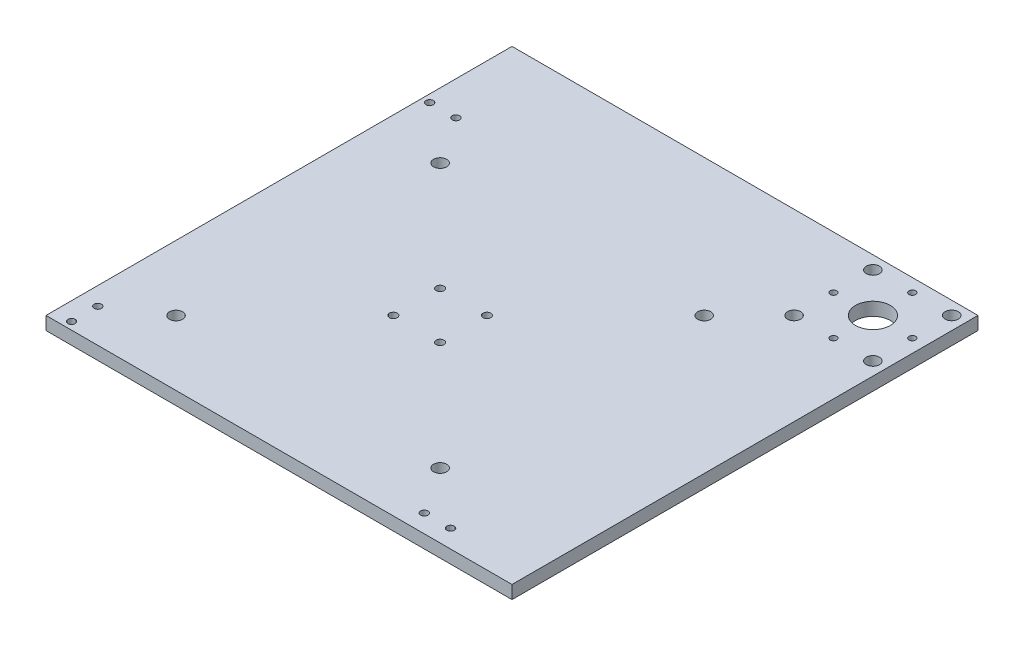
ISO-10303-21;
HEADER;
FILE_DESCRIPTION(('STEP AP214'),'2;1');
FILE_NAME('part.step','',(''),(''),'','','');
FILE_SCHEMA(('AUTOMOTIVE_DESIGN { 1 0 10303 214 1 1 1 1 }'));
ENDSEC;
DATA;
#1=APPLICATION_CONTEXT('core data for automotive mechanical design processes');
#2=APPLICATION_PROTOCOL_DEFINITION('international standard','automotive_design',2000,#1);
#3=PRODUCT_CONTEXT('',#1,'mechanical');
#4=PRODUCT('Part','Part','',(#3));
#5=PRODUCT_RELATED_PRODUCT_CATEGORY('part','',(#4));
#6=PRODUCT_DEFINITION_FORMATION('','',#4);
#7=PRODUCT_DEFINITION_CONTEXT('part definition',#1,'design');
#8=PRODUCT_DEFINITION('design','',#6,#7);
#9=PRODUCT_DEFINITION_SHAPE('','',#8);
#10=(LENGTH_UNIT() NAMED_UNIT(*) SI_UNIT(.MILLI.,.METRE.));
#11=(NAMED_UNIT(*) PLANE_ANGLE_UNIT() SI_UNIT($,.RADIAN.));
#12=(NAMED_UNIT(*) SI_UNIT($,.STERADIAN.) SOLID_ANGLE_UNIT());
#13=UNCERTAINTY_MEASURE_WITH_UNIT(LENGTH_MEASURE(1.E-05),#10,'distance_accuracy_value','');
#14=(GEOMETRIC_REPRESENTATION_CONTEXT(3) GLOBAL_UNCERTAINTY_ASSIGNED_CONTEXT((#13)) GLOBAL_UNIT_ASSIGNED_CONTEXT((#10,
#11,#12)) REPRESENTATION_CONTEXT('',''));
#15=CARTESIAN_POINT('',(0.,0.,0.));
#16=DIRECTION('',(0.,0.,1.));
#17=DIRECTION('',(1.,0.,0.));
#18=AXIS2_PLACEMENT_3D('',#15,#16,#17);
#19=CARTESIAN_POINT('',(0.,6.35,0.));
#20=DIRECTION('',(0.,1.,0.));
#21=DIRECTION('',(0.,0.,1.));
#22=AXIS2_PLACEMENT_3D('',#19,#20,#21);
#23=PLANE('',#22);
#24=CARTESIAN_POINT('',(104.600000000002,6.35000000000002,-104.6));
#25=DIRECTION('',(0.,-1.,0.));
#26=DIRECTION('',(0.,0.,-1.));
#27=AXIS2_PLACEMENT_3D('',#24,#25,#26);
#28=CIRCLE('',#27,8.41375000000001);
#29=CARTESIAN_POINT('',(104.600000000002,6.35000000000002,-113.01375));
#30=VERTEX_POINT('',#29);
#31=EDGE_CURVE('E390',#30,#30,#28,.T.);
#32=ORIENTED_EDGE('',*,*,#31,.T.);
#33=EDGE_LOOP('',(#32));
#34=FACE_BOUND('',#33,.T.);
#35=CARTESIAN_POINT('',(123.650000000001,6.35000000000002,-104.6));
#36=DIRECTION('',(0.,-1.,0.));
#37=DIRECTION('',(0.,0.,-1.));
#38=AXIS2_PLACEMENT_3D('',#35,#36,#37);
#39=CIRCLE('',#38,1.58749999999992);
#40=CARTESIAN_POINT('',(123.650000000001,6.35000000000002,-106.1875));
#41=VERTEX_POINT('',#40);
#42=EDGE_CURVE('E384',#41,#41,#39,.T.);
#43=ORIENTED_EDGE('',*,*,#42,.T.);
#44=EDGE_LOOP('',(#43));
#45=FACE_BOUND('',#44,.T.);
#46=CARTESIAN_POINT('',(104.600000000001,6.35000000000002,-85.5499999999999));
#47=DIRECTION('',(0.,-1.,0.));
#48=DIRECTION('',(0.,0.,-1.));
#49=AXIS2_PLACEMENT_3D('',#46,#47,#48);
#50=CIRCLE('',#49,1.58749999999994);
#51=CARTESIAN_POINT('',(104.600000000001,6.35000000000002,-87.1374999999998));
#52=VERTEX_POINT('',#51);
#53=EDGE_CURVE('E378',#52,#52,#50,.T.);
#54=ORIENTED_EDGE('',*,*,#53,.T.);
#55=EDGE_LOOP('',(#54));
#56=FACE_BOUND('',#55,.T.);
#57=CARTESIAN_POINT('',(85.5500000000013,6.35000000000002,-104.6));
#58=DIRECTION('',(0.,-1.,0.));
#59=DIRECTION('',(0.,0.,-1.));
#60=AXIS2_PLACEMENT_3D('',#57,#58,#59);
#61=CIRCLE('',#60,1.58749999999994);
#62=CARTESIAN_POINT('',(85.5500000000013,6.35000000000002,-106.1875));
#63=VERTEX_POINT('',#62);
#64=EDGE_CURVE('E372',#63,#63,#61,.T.);
#65=ORIENTED_EDGE('',*,*,#64,.T.);
#66=EDGE_LOOP('',(#65));
#67=FACE_BOUND('',#66,.T.);
#68=CARTESIAN_POINT('',(104.600000000001,6.35000000000002,-123.65));
#69=DIRECTION('',(0.,-1.,0.));
#70=DIRECTION('',(0.,0.,-1.));
#71=AXIS2_PLACEMENT_3D('',#68,#69,#70);
#72=CIRCLE('',#71,1.58749999999992);
#73=CARTESIAN_POINT('',(104.600000000001,6.35000000000002,-125.2375));
#74=VERTEX_POINT('',#73);
#75=EDGE_CURVE('E366',#74,#74,#72,.T.);
#76=ORIENTED_EDGE('',*,*,#75,.T.);
#77=EDGE_LOOP('',(#76));
#78=FACE_BOUND('',#77,.T.);
#79=CARTESIAN_POINT('',(85.5500000000023,6.35000000000002,-123.65));
#80=DIRECTION('',(0.,-1.,0.));
#81=DIRECTION('',(0.,0.,-1.));
#82=AXIS2_PLACEMENT_3D('',#79,#80,#81);
#83=CIRCLE('',#82,3.17499999999992);
#84=CARTESIAN_POINT('',(85.5500000000023,6.35000000000002,-126.825));
#85=VERTEX_POINT('',#84);
#86=EDGE_CURVE('E360',#85,#85,#83,.T.);
#87=ORIENTED_EDGE('',*,*,#86,.T.);
#88=EDGE_LOOP('',(#87));
#89=FACE_BOUND('',#88,.T.);
#90=CARTESIAN_POINT('',(123.650000000001,6.35000000000002,-85.5499999999997));
#91=DIRECTION('',(0.,-1.,0.));
#92=DIRECTION('',(0.,0.,-1.));
#93=AXIS2_PLACEMENT_3D('',#90,#91,#92);
#94=CIRCLE('',#93,3.17500000000064);
#95=CARTESIAN_POINT('',(123.650000000001,6.35000000000002,-88.7250000000003));
#96=VERTEX_POINT('',#95);
#97=EDGE_CURVE('E354',#96,#96,#94,.T.);
#98=ORIENTED_EDGE('',*,*,#97,.T.);
#99=EDGE_LOOP('',(#98));
#100=FACE_BOUND('',#99,.T.);
#101=CARTESIAN_POINT('',(85.5500000000007,6.35000000000002,-85.5499999999996));
#102=DIRECTION('',(0.,-1.,0.));
#103=DIRECTION('',(0.,0.,-1.));
#104=AXIS2_PLACEMENT_3D('',#101,#102,#103);
#105=CIRCLE('',#104,3.17500000000087);
#106=CARTESIAN_POINT('',(85.5500000000007,6.35000000000002,-88.7250000000005));
#107=VERTEX_POINT('',#106);
#108=EDGE_CURVE('E348',#107,#107,#105,.T.);
#109=ORIENTED_EDGE('',*,*,#108,.T.);
#110=EDGE_LOOP('',(#109));
#111=FACE_BOUND('',#110,.T.);
#112=CARTESIAN_POINT('',(123.649999999999,6.35000000000002,-123.65));
#113=DIRECTION('',(0.,-1.,0.));
#114=DIRECTION('',(0.,0.,-1.));
#115=AXIS2_PLACEMENT_3D('',#112,#113,#114);
#116=CIRCLE('',#115,3.17500000000147);
#117=CARTESIAN_POINT('',(123.649999999999,6.35000000000002,-126.825000000001));
#118=VERTEX_POINT('',#117);
#119=EDGE_CURVE('E342',#118,#118,#116,.T.);
#120=ORIENTED_EDGE('',*,*,#119,.T.);
#121=EDGE_LOOP('',(#120));
#122=FACE_BOUND('',#121,.T.);
#123=CARTESIAN_POINT('',(63.8746400504133,6.35000000000002,-63.7786400504133));
#124=DIRECTION('',(0.,-1.,0.));
#125=DIRECTION('',(0.,0.,-1.));
#126=AXIS2_PLACEMENT_3D('',#123,#124,#125);
#127=CIRCLE('',#126,3.17500000000001);
#128=CARTESIAN_POINT('',(63.8746400504133,6.35000000000002,-66.9536400504133));
#129=VERTEX_POINT('',#128);
#130=EDGE_CURVE('E336',#129,#129,#127,.T.);
#131=ORIENTED_EDGE('',*,*,#130,.T.);
#132=EDGE_LOOP('',(#131));
#133=FACE_BOUND('',#132,.T.);
#134=CARTESIAN_POINT('',(63.8746400504133,6.35000000000002,63.8746400504134));
#135=DIRECTION('',(0.,-1.,0.));
#136=DIRECTION('',(0.,0.,-1.));
#137=AXIS2_PLACEMENT_3D('',#134,#135,#136);
#138=CIRCLE('',#137,3.17500000000001);
#139=CARTESIAN_POINT('',(63.8746400504133,6.35000000000002,60.6996400504134));
#140=VERTEX_POINT('',#139);
#141=EDGE_CURVE('E330',#140,#140,#138,.T.);
#142=ORIENTED_EDGE('',*,*,#141,.T.);
#143=EDGE_LOOP('',(#142));
#144=FACE_BOUND('',#143,.T.);
#145=CARTESIAN_POINT('',(-63.7786400504134,6.35000000000002,63.8746400504134));
#146=DIRECTION('',(0.,-1.,0.));
#147=DIRECTION('',(0.,0.,-1.));
#148=AXIS2_PLACEMENT_3D('',#145,#146,#147);
#149=CIRCLE('',#148,3.17499999999995);
#150=CARTESIAN_POINT('',(-63.7786400504134,6.35000000000002,60.6996400504134));
#151=VERTEX_POINT('',#150);
#152=EDGE_CURVE('E324',#151,#151,#149,.T.);
#153=ORIENTED_EDGE('',*,*,#152,.T.);
#154=EDGE_LOOP('',(#153));
#155=FACE_BOUND('',#154,.T.);
#156=CARTESIAN_POINT('',(-63.7786400504134,6.35000000000002,-63.7786400504133));
#157=DIRECTION('',(0.,-1.,0.));
#158=DIRECTION('',(0.,0.,-1.));
#159=AXIS2_PLACEMENT_3D('',#156,#157,#158);
#160=CIRCLE('',#159,3.17499999999995);
#161=CARTESIAN_POINT('',(-63.7786400504134,6.35000000000002,-66.9536400504132));
#162=VERTEX_POINT('',#161);
#163=EDGE_CURVE('E247',#162,#162,#160,.T.);
#164=ORIENTED_EDGE('',*,*,#163,.T.);
#165=EDGE_LOOP('',(#164));
#166=FACE_BOUND('',#165,.T.);
#167=CARTESIAN_POINT('',(-11.303,6.35,-11.303));
#168=DIRECTION('',(0.,1.,0.));
#169=DIRECTION('',(0.,0.,1.));
#170=AXIS2_PLACEMENT_3D('',#167,#168,#169);
#171=CIRCLE('',#170,1.905);
#172=CARTESIAN_POINT('',(-11.303,6.35,-9.398));
#173=VERTEX_POINT('',#172);
#174=EDGE_CURVE('E258',#173,#173,#171,.T.);
#175=ORIENTED_EDGE('',*,*,#174,.F.);
#176=EDGE_LOOP('',(#175));
#177=FACE_BOUND('',#176,.T.);
#178=CARTESIAN_POINT('',(-11.303,6.35,11.303));
#179=DIRECTION('',(0.,1.,0.));
#180=DIRECTION('',(0.,0.,1.));
#181=AXIS2_PLACEMENT_3D('',#178,#179,#180);
#182=CIRCLE('',#181,1.905);
#183=CARTESIAN_POINT('',(-11.303,6.35,13.208));
#184=VERTEX_POINT('',#183);
#185=EDGE_CURVE('E270',#184,#184,#182,.T.);
#186=ORIENTED_EDGE('',*,*,#185,.F.);
#187=EDGE_LOOP('',(#186));
#188=FACE_BOUND('',#187,.T.);
#189=CARTESIAN_POINT('',(-78.9,6.35,-86.55));
#190=DIRECTION('',(0.,1.,0.));
#191=DIRECTION('',(0.,0.,1.));
#192=AXIS2_PLACEMENT_3D('',#189,#190,#191);
#193=CIRCLE('',#192,1.778);
#194=CARTESIAN_POINT('',(-78.9,6.35,-84.772));
#195=VERTEX_POINT('',#194);
#196=EDGE_CURVE('E282',#195,#195,#193,.T.);
#197=ORIENTED_EDGE('',*,*,#196,.F.);
#198=EDGE_LOOP('',(#197));
#199=FACE_BOUND('',#198,.T.);
#200=CARTESIAN_POINT('',(-86.55,6.35,78.9));
#201=DIRECTION('',(0.,1.,0.));
#202=DIRECTION('',(0.,0.,1.));
#203=AXIS2_PLACEMENT_3D('',#200,#201,#202);
#204=CIRCLE('',#203,1.778);
#205=CARTESIAN_POINT('',(-86.55,6.35,80.678));
#206=VERTEX_POINT('',#205);
#207=EDGE_CURVE('E294',#206,#206,#204,.T.);
#208=ORIENTED_EDGE('',*,*,#207,.F.);
#209=EDGE_LOOP('',(#208));
#210=FACE_BOUND('',#209,.T.);
#211=CARTESIAN_POINT('',(78.9,6.35,86.55));
#212=DIRECTION('',(0.,1.,0.));
#213=DIRECTION('',(0.,0.,1.));
#214=AXIS2_PLACEMENT_3D('',#211,#212,#213);
#215=CIRCLE('',#214,1.778);
#216=CARTESIAN_POINT('',(78.9,6.35,88.328));
#217=VERTEX_POINT('',#216);
#218=EDGE_CURVE('E306',#217,#217,#215,.T.);
#219=ORIENTED_EDGE('',*,*,#218,.F.);
#220=EDGE_LOOP('',(#219));
#221=FACE_BOUND('',#220,.T.);
#222=DIRECTION('',(1.,0.,0.));
#223=VECTOR('',#222,1.);
#224=CARTESIAN_POINT('',(-95.25,6.35,95.25));
#225=LINE('',#224,#223);
#226=CARTESIAN_POINT('',(-95.25,6.35,95.25));
#227=VERTEX_POINT('',#226);
#228=CARTESIAN_POINT('',(130.,6.35000000000002,95.25));
#229=VERTEX_POINT('',#228);
#230=EDGE_CURVE('E244',#227,#229,#225,.T.);
#231=ORIENTED_EDGE('',*,*,#230,.T.);
#232=DIRECTION('',(0.,0.,1.));
#233=VECTOR('',#232,1.);
#234=CARTESIAN_POINT('',(130.,6.35000000000002,-78.1999999999997));
#235=LINE('',#234,#233);
#236=CARTESIAN_POINT('',(130.,6.35000000000002,-130.));
#237=VERTEX_POINT('',#236);
#238=EDGE_CURVE('E223',#237,#229,#235,.T.);
#239=ORIENTED_EDGE('',*,*,#238,.F.);
#240=DIRECTION('',(-1.,0.,0.));
#241=VECTOR('',#240,1.);
#242=CARTESIAN_POINT('',(130.,6.35000000000002,-130.));
#243=LINE('',#242,#241);
#244=CARTESIAN_POINT('',(-95.25,6.35000000000002,-130.));
#245=VERTEX_POINT('',#244);
#246=EDGE_CURVE('E235',#237,#245,#243,.T.);
#247=ORIENTED_EDGE('',*,*,#246,.T.);
#248=DIRECTION('',(0.,0.,-1.));
#249=VECTOR('',#248,1.);
#250=CARTESIAN_POINT('',(-95.25,6.35,95.25));
#251=LINE('',#250,#249);
#252=EDGE_CURVE('E192',#227,#245,#251,.T.);
#253=ORIENTED_EDGE('',*,*,#252,.F.);
#254=EDGE_LOOP('',(#231,#239,#247,#253));
#255=FACE_BOUND('',#254,.T.);
#256=CARTESIAN_POINT('',(91.6,6.35,86.55));
#257=DIRECTION('',(0.,1.,0.));
#258=DIRECTION('',(0.,0.,1.));
#259=AXIS2_PLACEMENT_3D('',#256,#257,#258);
#260=CIRCLE('',#259,1.778);
#261=CARTESIAN_POINT('',(91.6,6.35,88.328));
#262=VERTEX_POINT('',#261);
#263=EDGE_CURVE('E300',#262,#262,#260,.T.);
#264=ORIENTED_EDGE('',*,*,#263,.F.);
#265=EDGE_LOOP('',(#264));
#266=FACE_BOUND('',#265,.T.);
#267=CARTESIAN_POINT('',(-86.55,6.35,91.6));
#268=DIRECTION('',(0.,1.,0.));
#269=DIRECTION('',(0.,0.,1.));
#270=AXIS2_PLACEMENT_3D('',#267,#268,#269);
#271=CIRCLE('',#270,1.778);
#272=CARTESIAN_POINT('',(-86.55,6.35,93.378));
#273=VERTEX_POINT('',#272);
#274=EDGE_CURVE('E288',#273,#273,#271,.T.);
#275=ORIENTED_EDGE('',*,*,#274,.F.);
#276=EDGE_LOOP('',(#275));
#277=FACE_BOUND('',#276,.T.);
#278=CARTESIAN_POINT('',(-91.6,6.35,-86.55));
#279=DIRECTION('',(0.,1.,0.));
#280=DIRECTION('',(0.,0.,1.));
#281=AXIS2_PLACEMENT_3D('',#278,#279,#280);
#282=CIRCLE('',#281,1.778);
#283=CARTESIAN_POINT('',(-91.6,6.35,-84.772));
#284=VERTEX_POINT('',#283);
#285=EDGE_CURVE('E276',#284,#284,#282,.T.);
#286=ORIENTED_EDGE('',*,*,#285,.F.);
#287=EDGE_LOOP('',(#286));
#288=FACE_BOUND('',#287,.T.);
#289=CARTESIAN_POINT('',(11.303,6.35,11.303));
#290=DIRECTION('',(0.,1.,0.));
#291=DIRECTION('',(0.,0.,1.));
#292=AXIS2_PLACEMENT_3D('',#289,#290,#291);
#293=CIRCLE('',#292,1.905);
#294=CARTESIAN_POINT('',(11.303,6.35,13.208));
#295=VERTEX_POINT('',#294);
#296=EDGE_CURVE('E264',#295,#295,#293,.T.);
#297=ORIENTED_EDGE('',*,*,#296,.F.);
#298=EDGE_LOOP('',(#297));
#299=FACE_BOUND('',#298,.T.);
#300=CARTESIAN_POINT('',(11.303,6.35,-11.303));
#301=DIRECTION('',(0.,1.,0.));
#302=DIRECTION('',(0.,0.,1.));
#303=AXIS2_PLACEMENT_3D('',#300,#301,#302);
#304=CIRCLE('',#303,1.905);
#305=CARTESIAN_POINT('',(11.303,6.35,-9.398));
#306=VERTEX_POINT('',#305);
#307=EDGE_CURVE('E252',#306,#306,#304,.T.);
#308=ORIENTED_EDGE('',*,*,#307,.F.);
#309=EDGE_LOOP('',(#308));
#310=FACE_BOUND('',#309,.T.);
#311=ADVANCED_FACE('F183',(#34,#45,#56,#67,#78,#89,#100,#111,#122,#133,#144,#155,#166,#177,#188,
#199,#210,#221,#255,#266,#277,#288,#299,#310),#23,.T.);
#312=CARTESIAN_POINT('',(0.,0.,0.));
#313=DIRECTION('',(0.,1.,0.));
#314=DIRECTION('',(0.,0.,1.));
#315=AXIS2_PLACEMENT_3D('',#312,#313,#314);
#316=PLANE('',#315);
#317=CARTESIAN_POINT('',(104.600000000002,0.,-104.6));
#318=DIRECTION('',(0.,-1.,0.));
#319=DIRECTION('',(0.,0.,-1.));
#320=AXIS2_PLACEMENT_3D('',#317,#318,#319);
#321=CIRCLE('',#320,8.41375000000001);
#322=CARTESIAN_POINT('',(104.600000000002,0.,-113.01375));
#323=VERTEX_POINT('',#322);
#324=EDGE_CURVE('E393',#323,#323,#321,.T.);
#325=ORIENTED_EDGE('',*,*,#324,.F.);
#326=EDGE_LOOP('',(#325));
#327=FACE_BOUND('',#326,.T.);
#328=CARTESIAN_POINT('',(123.650000000001,0.,-104.6));
#329=DIRECTION('',(0.,-1.,0.));
#330=DIRECTION('',(0.,0.,-1.));
#331=AXIS2_PLACEMENT_3D('',#328,#329,#330);
#332=CIRCLE('',#331,1.58749999999992);
#333=CARTESIAN_POINT('',(123.650000000001,0.,-106.1875));
#334=VERTEX_POINT('',#333);
#335=EDGE_CURVE('E387',#334,#334,#332,.T.);
#336=ORIENTED_EDGE('',*,*,#335,.F.);
#337=EDGE_LOOP('',(#336));
#338=FACE_BOUND('',#337,.T.);
#339=CARTESIAN_POINT('',(104.600000000001,0.,-85.5499999999999));
#340=DIRECTION('',(0.,-1.,0.));
#341=DIRECTION('',(0.,0.,-1.));
#342=AXIS2_PLACEMENT_3D('',#339,#340,#341);
#343=CIRCLE('',#342,1.58749999999994);
#344=CARTESIAN_POINT('',(104.600000000001,0.,-87.1374999999998));
#345=VERTEX_POINT('',#344);
#346=EDGE_CURVE('E381',#345,#345,#343,.T.);
#347=ORIENTED_EDGE('',*,*,#346,.F.);
#348=EDGE_LOOP('',(#347));
#349=FACE_BOUND('',#348,.T.);
#350=CARTESIAN_POINT('',(85.5500000000013,0.,-104.6));
#351=DIRECTION('',(0.,-1.,0.));
#352=DIRECTION('',(0.,0.,-1.));
#353=AXIS2_PLACEMENT_3D('',#350,#351,#352);
#354=CIRCLE('',#353,1.58749999999994);
#355=CARTESIAN_POINT('',(85.5500000000013,0.,-106.1875));
#356=VERTEX_POINT('',#355);
#357=EDGE_CURVE('E375',#356,#356,#354,.T.);
#358=ORIENTED_EDGE('',*,*,#357,.F.);
#359=EDGE_LOOP('',(#358));
#360=FACE_BOUND('',#359,.T.);
#361=CARTESIAN_POINT('',(104.600000000001,0.,-123.65));
#362=DIRECTION('',(0.,-1.,0.));
#363=DIRECTION('',(0.,0.,-1.));
#364=AXIS2_PLACEMENT_3D('',#361,#362,#363);
#365=CIRCLE('',#364,1.58749999999992);
#366=CARTESIAN_POINT('',(104.600000000001,0.,-125.2375));
#367=VERTEX_POINT('',#366);
#368=EDGE_CURVE('E369',#367,#367,#365,.T.);
#369=ORIENTED_EDGE('',*,*,#368,.F.);
#370=EDGE_LOOP('',(#369));
#371=FACE_BOUND('',#370,.T.);
#372=CARTESIAN_POINT('',(85.5500000000023,0.,-123.65));
#373=DIRECTION('',(0.,-1.,0.));
#374=DIRECTION('',(0.,0.,-1.));
#375=AXIS2_PLACEMENT_3D('',#372,#373,#374);
#376=CIRCLE('',#375,3.17499999999992);
#377=CARTESIAN_POINT('',(85.5500000000023,0.,-126.825));
#378=VERTEX_POINT('',#377);
#379=EDGE_CURVE('E363',#378,#378,#376,.T.);
#380=ORIENTED_EDGE('',*,*,#379,.F.);
#381=EDGE_LOOP('',(#380));
#382=FACE_BOUND('',#381,.T.);
#383=CARTESIAN_POINT('',(123.650000000001,0.,-85.5499999999997));
#384=DIRECTION('',(0.,-1.,0.));
#385=DIRECTION('',(0.,0.,-1.));
#386=AXIS2_PLACEMENT_3D('',#383,#384,#385);
#387=CIRCLE('',#386,3.17500000000064);
#388=CARTESIAN_POINT('',(123.650000000001,0.,-88.7250000000003));
#389=VERTEX_POINT('',#388);
#390=EDGE_CURVE('E357',#389,#389,#387,.T.);
#391=ORIENTED_EDGE('',*,*,#390,.F.);
#392=EDGE_LOOP('',(#391));
#393=FACE_BOUND('',#392,.T.);
#394=CARTESIAN_POINT('',(85.5500000000007,0.,-85.5499999999996));
#395=DIRECTION('',(0.,-1.,0.));
#396=DIRECTION('',(0.,0.,-1.));
#397=AXIS2_PLACEMENT_3D('',#394,#395,#396);
#398=CIRCLE('',#397,3.17500000000087);
#399=CARTESIAN_POINT('',(85.5500000000007,0.,-88.7250000000005));
#400=VERTEX_POINT('',#399);
#401=EDGE_CURVE('E351',#400,#400,#398,.T.);
#402=ORIENTED_EDGE('',*,*,#401,.F.);
#403=EDGE_LOOP('',(#402));
#404=FACE_BOUND('',#403,.T.);
#405=CARTESIAN_POINT('',(123.649999999999,0.,-123.65));
#406=DIRECTION('',(0.,-1.,0.));
#407=DIRECTION('',(0.,0.,-1.));
#408=AXIS2_PLACEMENT_3D('',#405,#406,#407);
#409=CIRCLE('',#408,3.17500000000147);
#410=CARTESIAN_POINT('',(123.649999999999,0.,-126.825000000001));
#411=VERTEX_POINT('',#410);
#412=EDGE_CURVE('E345',#411,#411,#409,.T.);
#413=ORIENTED_EDGE('',*,*,#412,.F.);
#414=EDGE_LOOP('',(#413));
#415=FACE_BOUND('',#414,.T.);
#416=CARTESIAN_POINT('',(63.8746400504133,0.,-63.7786400504133));
#417=DIRECTION('',(0.,-1.,0.));
#418=DIRECTION('',(0.,0.,-1.));
#419=AXIS2_PLACEMENT_3D('',#416,#417,#418);
#420=CIRCLE('',#419,3.17500000000001);
#421=CARTESIAN_POINT('',(63.8746400504133,0.,-66.9536400504133));
#422=VERTEX_POINT('',#421);
#423=EDGE_CURVE('E339',#422,#422,#420,.T.);
#424=ORIENTED_EDGE('',*,*,#423,.F.);
#425=EDGE_LOOP('',(#424));
#426=FACE_BOUND('',#425,.T.);
#427=CARTESIAN_POINT('',(63.8746400504133,0.,63.8746400504134));
#428=DIRECTION('',(0.,-1.,0.));
#429=DIRECTION('',(0.,0.,-1.));
#430=AXIS2_PLACEMENT_3D('',#427,#428,#429);
#431=CIRCLE('',#430,3.17500000000001);
#432=CARTESIAN_POINT('',(63.8746400504133,0.,60.6996400504134));
#433=VERTEX_POINT('',#432);
#434=EDGE_CURVE('E333',#433,#433,#431,.T.);
#435=ORIENTED_EDGE('',*,*,#434,.F.);
#436=EDGE_LOOP('',(#435));
#437=FACE_BOUND('',#436,.T.);
#438=CARTESIAN_POINT('',(-63.7786400504134,0.,63.8746400504134));
#439=DIRECTION('',(0.,-1.,0.));
#440=DIRECTION('',(0.,0.,-1.));
#441=AXIS2_PLACEMENT_3D('',#438,#439,#440);
#442=CIRCLE('',#441,3.17499999999995);
#443=CARTESIAN_POINT('',(-63.7786400504134,0.,60.6996400504134));
#444=VERTEX_POINT('',#443);
#445=EDGE_CURVE('E327',#444,#444,#442,.T.);
#446=ORIENTED_EDGE('',*,*,#445,.F.);
#447=EDGE_LOOP('',(#446));
#448=FACE_BOUND('',#447,.T.);
#449=CARTESIAN_POINT('',(-63.7786400504134,0.,-63.7786400504133));
#450=DIRECTION('',(0.,-1.,0.));
#451=DIRECTION('',(0.,0.,-1.));
#452=AXIS2_PLACEMENT_3D('',#449,#450,#451);
#453=CIRCLE('',#452,3.17499999999995);
#454=CARTESIAN_POINT('',(-63.7786400504134,0.,-66.9536400504132));
#455=VERTEX_POINT('',#454);
#456=EDGE_CURVE('E321',#455,#455,#453,.T.);
#457=ORIENTED_EDGE('',*,*,#456,.F.);
#458=EDGE_LOOP('',(#457));
#459=FACE_BOUND('',#458,.T.);
#460=CARTESIAN_POINT('',(-11.303,0.,-11.303));
#461=DIRECTION('',(0.,1.,0.));
#462=DIRECTION('',(0.,0.,1.));
#463=AXIS2_PLACEMENT_3D('',#460,#461,#462);
#464=CIRCLE('',#463,1.905);
#465=CARTESIAN_POINT('',(-11.303,0.,-9.398));
#466=VERTEX_POINT('',#465);
#467=EDGE_CURVE('E255',#466,#466,#464,.T.);
#468=ORIENTED_EDGE('',*,*,#467,.T.);
#469=EDGE_LOOP('',(#468));
#470=FACE_BOUND('',#469,.T.);
#471=CARTESIAN_POINT('',(-11.303,0.,11.303));
#472=DIRECTION('',(0.,1.,0.));
#473=DIRECTION('',(0.,0.,1.));
#474=AXIS2_PLACEMENT_3D('',#471,#472,#473);
#475=CIRCLE('',#474,1.905);
#476=CARTESIAN_POINT('',(-11.303,0.,13.208));
#477=VERTEX_POINT('',#476);
#478=EDGE_CURVE('E267',#477,#477,#475,.T.);
#479=ORIENTED_EDGE('',*,*,#478,.T.);
#480=EDGE_LOOP('',(#479));
#481=FACE_BOUND('',#480,.T.);
#482=CARTESIAN_POINT('',(-78.9,0.,-86.55));
#483=DIRECTION('',(0.,1.,0.));
#484=DIRECTION('',(0.,0.,1.));
#485=AXIS2_PLACEMENT_3D('',#482,#483,#484);
#486=CIRCLE('',#485,1.778);
#487=CARTESIAN_POINT('',(-78.9,0.,-84.772));
#488=VERTEX_POINT('',#487);
#489=EDGE_CURVE('E279',#488,#488,#486,.T.);
#490=ORIENTED_EDGE('',*,*,#489,.T.);
#491=EDGE_LOOP('',(#490));
#492=FACE_BOUND('',#491,.T.);
#493=CARTESIAN_POINT('',(-86.55,0.,78.9));
#494=DIRECTION('',(0.,1.,0.));
#495=DIRECTION('',(0.,0.,1.));
#496=AXIS2_PLACEMENT_3D('',#493,#494,#495);
#497=CIRCLE('',#496,1.778);
#498=CARTESIAN_POINT('',(-86.55,0.,80.678));
#499=VERTEX_POINT('',#498);
#500=EDGE_CURVE('E291',#499,#499,#497,.T.);
#501=ORIENTED_EDGE('',*,*,#500,.T.);
#502=EDGE_LOOP('',(#501));
#503=FACE_BOUND('',#502,.T.);
#504=CARTESIAN_POINT('',(78.9,0.,86.55));
#505=DIRECTION('',(0.,1.,0.));
#506=DIRECTION('',(0.,0.,1.));
#507=AXIS2_PLACEMENT_3D('',#504,#505,#506);
#508=CIRCLE('',#507,1.778);
#509=CARTESIAN_POINT('',(78.9,0.,88.328));
#510=VERTEX_POINT('',#509);
#511=EDGE_CURVE('E303',#510,#510,#508,.T.);
#512=ORIENTED_EDGE('',*,*,#511,.T.);
#513=EDGE_LOOP('',(#512));
#514=FACE_BOUND('',#513,.T.);
#515=DIRECTION('',(1.,0.,0.));
#516=VECTOR('',#515,1.);
#517=CARTESIAN_POINT('',(-95.25,0.,95.25));
#518=LINE('',#517,#516);
#519=CARTESIAN_POINT('',(-95.25,0.,95.25));
#520=VERTEX_POINT('',#519);
#521=CARTESIAN_POINT('',(130.,0.,95.25));
#522=VERTEX_POINT('',#521);
#523=EDGE_CURVE('E309',#520,#522,#518,.T.);
#524=ORIENTED_EDGE('',*,*,#523,.F.);
#525=DIRECTION('',(0.,0.,-1.));
#526=VECTOR('',#525,1.);
#527=CARTESIAN_POINT('',(-95.25,0.,95.25));
#528=LINE('',#527,#526);
#529=CARTESIAN_POINT('',(-95.25,0.,-130.));
#530=VERTEX_POINT('',#529);
#531=EDGE_CURVE('E313',#520,#530,#528,.T.);
#532=ORIENTED_EDGE('',*,*,#531,.T.);
#533=DIRECTION('',(-1.,0.,0.));
#534=VECTOR('',#533,1.);
#535=CARTESIAN_POINT('',(130.,0.,-130.));
#536=LINE('',#535,#534);
#537=CARTESIAN_POINT('',(130.,0.,-130.));
#538=VERTEX_POINT('',#537);
#539=EDGE_CURVE('E230',#538,#530,#536,.T.);
#540=ORIENTED_EDGE('',*,*,#539,.F.);
#541=DIRECTION('',(0.,0.,1.));
#542=VECTOR('',#541,1.);
#543=CARTESIAN_POINT('',(130.,0.,-78.1999999999997));
#544=LINE('',#543,#542);
#545=EDGE_CURVE('E226',#538,#522,#544,.T.);
#546=ORIENTED_EDGE('',*,*,#545,.T.);
#547=EDGE_LOOP('',(#524,#532,#540,#546));
#548=FACE_BOUND('',#547,.T.);
#549=CARTESIAN_POINT('',(91.6,0.,86.55));
#550=DIRECTION('',(0.,1.,0.));
#551=DIRECTION('',(0.,0.,1.));
#552=AXIS2_PLACEMENT_3D('',#549,#550,#551);
#553=CIRCLE('',#552,1.778);
#554=CARTESIAN_POINT('',(91.6,0.,88.328));
#555=VERTEX_POINT('',#554);
#556=EDGE_CURVE('E297',#555,#555,#553,.T.);
#557=ORIENTED_EDGE('',*,*,#556,.T.);
#558=EDGE_LOOP('',(#557));
#559=FACE_BOUND('',#558,.T.);
#560=CARTESIAN_POINT('',(-86.55,0.,91.6));
#561=DIRECTION('',(0.,1.,0.));
#562=DIRECTION('',(0.,0.,1.));
#563=AXIS2_PLACEMENT_3D('',#560,#561,#562);
#564=CIRCLE('',#563,1.778);
#565=CARTESIAN_POINT('',(-86.55,0.,93.378));
#566=VERTEX_POINT('',#565);
#567=EDGE_CURVE('E285',#566,#566,#564,.T.);
#568=ORIENTED_EDGE('',*,*,#567,.T.);
#569=EDGE_LOOP('',(#568));
#570=FACE_BOUND('',#569,.T.);
#571=CARTESIAN_POINT('',(-91.6,0.,-86.55));
#572=DIRECTION('',(0.,1.,0.));
#573=DIRECTION('',(0.,0.,1.));
#574=AXIS2_PLACEMENT_3D('',#571,#572,#573);
#575=CIRCLE('',#574,1.778);
#576=CARTESIAN_POINT('',(-91.6,0.,-84.772));
#577=VERTEX_POINT('',#576);
#578=EDGE_CURVE('E273',#577,#577,#575,.T.);
#579=ORIENTED_EDGE('',*,*,#578,.T.);
#580=EDGE_LOOP('',(#579));
#581=FACE_BOUND('',#580,.T.);
#582=CARTESIAN_POINT('',(11.303,0.,11.303));
#583=DIRECTION('',(0.,1.,0.));
#584=DIRECTION('',(0.,0.,1.));
#585=AXIS2_PLACEMENT_3D('',#582,#583,#584);
#586=CIRCLE('',#585,1.905);
#587=CARTESIAN_POINT('',(11.303,0.,13.208));
#588=VERTEX_POINT('',#587);
#589=EDGE_CURVE('E261',#588,#588,#586,.T.);
#590=ORIENTED_EDGE('',*,*,#589,.T.);
#591=EDGE_LOOP('',(#590));
#592=FACE_BOUND('',#591,.T.);
#593=CARTESIAN_POINT('',(11.303,0.,-11.303));
#594=DIRECTION('',(0.,1.,0.));
#595=DIRECTION('',(0.,0.,1.));
#596=AXIS2_PLACEMENT_3D('',#593,#594,#595);
#597=CIRCLE('',#596,1.905);
#598=CARTESIAN_POINT('',(11.303,0.,-9.398));
#599=VERTEX_POINT('',#598);
#600=EDGE_CURVE('E241',#599,#599,#597,.T.);
#601=ORIENTED_EDGE('',*,*,#600,.T.);
#602=EDGE_LOOP('',(#601));
#603=FACE_BOUND('',#602,.T.);
#604=ADVANCED_FACE('F317',(#327,#338,#349,#360,#371,#382,#393,#404,#415,#426,#437,#448,#459,
#470,#481,#492,#503,#514,#548,#559,#570,#581,#592,#603),#316,.F.);
#605=CARTESIAN_POINT('',(-95.25,6.35,95.25));
#606=DIRECTION('',(0.,0.,-1.));
#607=DIRECTION('',(-1.,0.,0.));
#608=AXIS2_PLACEMENT_3D('',#605,#606,#607);
#609=PLANE('',#608);
#610=ORIENTED_EDGE('',*,*,#523,.T.);
#611=DIRECTION('',(0.,-1.,0.));
#612=VECTOR('',#611,1.);
#613=CARTESIAN_POINT('',(130.,324.90160492454,95.25));
#614=LINE('',#613,#612);
#615=EDGE_CURVE('E231',#229,#522,#614,.T.);
#616=ORIENTED_EDGE('',*,*,#615,.F.);
#617=ORIENTED_EDGE('',*,*,#230,.F.);
#618=DIRECTION('',(0.,-1.,0.));
#619=VECTOR('',#618,1.);
#620=CARTESIAN_POINT('',(-95.25,6.35,95.25));
#621=LINE('',#620,#619);
#622=EDGE_CURVE('E12',#227,#520,#621,.T.);
#623=ORIENTED_EDGE('',*,*,#622,.T.);
#624=EDGE_LOOP('',(#610,#616,#617,#623));
#625=FACE_BOUND('',#624,.T.);
#626=ADVANCED_FACE('F185',(#625),#609,.F.);
#627=CARTESIAN_POINT('',(-95.25,6.35,95.25));
#628=DIRECTION('',(-1.,0.,0.));
#629=DIRECTION('',(0.,0.,1.));
#630=AXIS2_PLACEMENT_3D('',#627,#628,#629);
#631=PLANE('',#630);
#632=ORIENTED_EDGE('',*,*,#531,.F.);
#633=ORIENTED_EDGE('',*,*,#622,.F.);
#634=ORIENTED_EDGE('',*,*,#252,.T.);
#635=DIRECTION('',(0.,-1.,0.));
#636=VECTOR('',#635,1.);
#637=CARTESIAN_POINT('',(-95.25,324.90160492454,-130.));
#638=LINE('',#637,#636);
#639=EDGE_CURVE('E238',#245,#530,#638,.T.);
#640=ORIENTED_EDGE('',*,*,#639,.T.);
#641=EDGE_LOOP('',(#632,#633,#634,#640));
#642=FACE_BOUND('',#641,.T.);
#643=ADVANCED_FACE('F319',(#642),#631,.T.);
#644=CARTESIAN_POINT('',(78.9,6.35,86.55));
#645=DIRECTION('',(0.,-1.,0.));
#646=DIRECTION('',(0.,0.,-1.));
#647=AXIS2_PLACEMENT_3D('',#644,#645,#646);
#648=CYLINDRICAL_SURFACE('',#647,1.778);
#649=ORIENTED_EDGE('',*,*,#218,.T.);
#650=EDGE_LOOP('',(#649));
#651=FACE_BOUND('',#650,.T.);
#652=ORIENTED_EDGE('',*,*,#511,.F.);
#653=EDGE_LOOP('',(#652));
#654=FACE_BOUND('',#653,.T.);
#655=ADVANCED_FACE('F445',(#651,#654),#648,.F.);
#656=CARTESIAN_POINT('',(91.6,6.35,86.55));
#657=DIRECTION('',(0.,-1.,0.));
#658=DIRECTION('',(0.,0.,-1.));
#659=AXIS2_PLACEMENT_3D('',#656,#657,#658);
#660=CYLINDRICAL_SURFACE('',#659,1.778);
#661=ORIENTED_EDGE('',*,*,#263,.T.);
#662=EDGE_LOOP('',(#661));
#663=FACE_BOUND('',#662,.T.);
#664=ORIENTED_EDGE('',*,*,#556,.F.);
#665=EDGE_LOOP('',(#664));
#666=FACE_BOUND('',#665,.T.);
#667=ADVANCED_FACE('F447',(#663,#666),#660,.F.);
#668=CARTESIAN_POINT('',(-86.55,6.35,78.9));
#669=DIRECTION('',(0.,-1.,0.));
#670=DIRECTION('',(0.,0.,-1.));
#671=AXIS2_PLACEMENT_3D('',#668,#669,#670);
#672=CYLINDRICAL_SURFACE('',#671,1.778);
#673=ORIENTED_EDGE('',*,*,#207,.T.);
#674=EDGE_LOOP('',(#673));
#675=FACE_BOUND('',#674,.T.);
#676=ORIENTED_EDGE('',*,*,#500,.F.);
#677=EDGE_LOOP('',(#676));
#678=FACE_BOUND('',#677,.T.);
#679=ADVANCED_FACE('F454',(#675,#678),#672,.F.);
#680=CARTESIAN_POINT('',(-86.55,6.35,91.6));
#681=DIRECTION('',(0.,-1.,0.));
#682=DIRECTION('',(0.,0.,-1.));
#683=AXIS2_PLACEMENT_3D('',#680,#681,#682);
#684=CYLINDRICAL_SURFACE('',#683,1.778);
#685=ORIENTED_EDGE('',*,*,#274,.T.);
#686=EDGE_LOOP('',(#685));
#687=FACE_BOUND('',#686,.T.);
#688=ORIENTED_EDGE('',*,*,#567,.F.);
#689=EDGE_LOOP('',(#688));
#690=FACE_BOUND('',#689,.T.);
#691=ADVANCED_FACE('F650',(#687,#690),#684,.F.);
#692=CARTESIAN_POINT('',(-78.9,6.35,-86.55));
#693=DIRECTION('',(0.,-1.,0.));
#694=DIRECTION('',(0.,0.,-1.));
#695=AXIS2_PLACEMENT_3D('',#692,#693,#694);
#696=CYLINDRICAL_SURFACE('',#695,1.778);
#697=ORIENTED_EDGE('',*,*,#196,.T.);
#698=EDGE_LOOP('',(#697));
#699=FACE_BOUND('',#698,.T.);
#700=ORIENTED_EDGE('',*,*,#489,.F.);
#701=EDGE_LOOP('',(#700));
#702=FACE_BOUND('',#701,.T.);
#703=ADVANCED_FACE('F646',(#699,#702),#696,.F.);
#704=CARTESIAN_POINT('',(-91.6,6.35,-86.55));
#705=DIRECTION('',(0.,-1.,0.));
#706=DIRECTION('',(0.,0.,-1.));
#707=AXIS2_PLACEMENT_3D('',#704,#705,#706);
#708=CYLINDRICAL_SURFACE('',#707,1.778);
#709=ORIENTED_EDGE('',*,*,#285,.T.);
#710=EDGE_LOOP('',(#709));
#711=FACE_BOUND('',#710,.T.);
#712=ORIENTED_EDGE('',*,*,#578,.F.);
#713=EDGE_LOOP('',(#712));
#714=FACE_BOUND('',#713,.T.);
#715=ADVANCED_FACE('F642',(#711,#714),#708,.F.);
#716=CARTESIAN_POINT('',(-11.303,6.35,11.303));
#717=DIRECTION('',(0.,-1.,0.));
#718=DIRECTION('',(0.,0.,-1.));
#719=AXIS2_PLACEMENT_3D('',#716,#717,#718);
#720=CYLINDRICAL_SURFACE('',#719,1.905);
#721=ORIENTED_EDGE('',*,*,#185,.T.);
#722=EDGE_LOOP('',(#721));
#723=FACE_BOUND('',#722,.T.);
#724=ORIENTED_EDGE('',*,*,#478,.F.);
#725=EDGE_LOOP('',(#724));
#726=FACE_BOUND('',#725,.T.);
#727=ADVANCED_FACE('F638',(#723,#726),#720,.F.);
#728=CARTESIAN_POINT('',(11.303,6.35,11.303));
#729=DIRECTION('',(0.,-1.,0.));
#730=DIRECTION('',(0.,0.,-1.));
#731=AXIS2_PLACEMENT_3D('',#728,#729,#730);
#732=CYLINDRICAL_SURFACE('',#731,1.905);
#733=ORIENTED_EDGE('',*,*,#296,.T.);
#734=EDGE_LOOP('',(#733));
#735=FACE_BOUND('',#734,.T.);
#736=ORIENTED_EDGE('',*,*,#589,.F.);
#737=EDGE_LOOP('',(#736));
#738=FACE_BOUND('',#737,.T.);
#739=ADVANCED_FACE('F634',(#735,#738),#732,.F.);
#740=CARTESIAN_POINT('',(-11.303,6.35,-11.303));
#741=DIRECTION('',(0.,-1.,0.));
#742=DIRECTION('',(0.,0.,-1.));
#743=AXIS2_PLACEMENT_3D('',#740,#741,#742);
#744=CYLINDRICAL_SURFACE('',#743,1.905);
#745=ORIENTED_EDGE('',*,*,#174,.T.);
#746=EDGE_LOOP('',(#745));
#747=FACE_BOUND('',#746,.T.);
#748=ORIENTED_EDGE('',*,*,#467,.F.);
#749=EDGE_LOOP('',(#748));
#750=FACE_BOUND('',#749,.T.);
#751=ADVANCED_FACE('F630',(#747,#750),#744,.F.);
#752=CARTESIAN_POINT('',(11.303,6.35,-11.303));
#753=DIRECTION('',(0.,-1.,0.));
#754=DIRECTION('',(0.,0.,-1.));
#755=AXIS2_PLACEMENT_3D('',#752,#753,#754);
#756=CYLINDRICAL_SURFACE('',#755,1.905);
#757=ORIENTED_EDGE('',*,*,#307,.T.);
#758=EDGE_LOOP('',(#757));
#759=FACE_BOUND('',#758,.T.);
#760=ORIENTED_EDGE('',*,*,#600,.F.);
#761=EDGE_LOOP('',(#760));
#762=FACE_BOUND('',#761,.T.);
#763=ADVANCED_FACE('F489',(#759,#762),#756,.F.);
#764=CARTESIAN_POINT('',(130.,324.90160492454,-78.1999999999997));
#765=DIRECTION('',(1.,0.,0.));
#766=DIRECTION('',(0.,0.,-1.));
#767=AXIS2_PLACEMENT_3D('',#764,#765,#766);
#768=PLANE('',#767);
#769=DIRECTION('',(0.,-1.,0.));
#770=VECTOR('',#769,1.);
#771=CARTESIAN_POINT('',(130.,324.90160492454,-130.));
#772=LINE('',#771,#770);
#773=EDGE_CURVE('E218',#237,#538,#772,.T.);
#774=ORIENTED_EDGE('',*,*,#773,.F.);
#775=ORIENTED_EDGE('',*,*,#238,.T.);
#776=ORIENTED_EDGE('',*,*,#615,.T.);
#777=ORIENTED_EDGE('',*,*,#545,.F.);
#778=EDGE_LOOP('',(#774,#775,#776,#777));
#779=FACE_BOUND('',#778,.T.);
#780=ADVANCED_FACE('F220',(#779),#768,.T.);
#781=CARTESIAN_POINT('',(130.,324.90160492454,-130.));
#782=DIRECTION('',(0.,0.,1.));
#783=DIRECTION('',(1.,0.,0.));
#784=AXIS2_PLACEMENT_3D('',#781,#782,#783);
#785=PLANE('',#784);
#786=ORIENTED_EDGE('',*,*,#246,.F.);
#787=ORIENTED_EDGE('',*,*,#773,.T.);
#788=ORIENTED_EDGE('',*,*,#539,.T.);
#789=ORIENTED_EDGE('',*,*,#639,.F.);
#790=EDGE_LOOP('',(#786,#787,#788,#789));
#791=FACE_BOUND('',#790,.T.);
#792=ADVANCED_FACE('F236',(#791),#785,.F.);
#793=CARTESIAN_POINT('',(-63.7786400504134,6.35000000000002,-63.7786400504133));
#794=DIRECTION('',(0.,-1.,0.));
#795=DIRECTION('',(0.,0.,-1.));
#796=AXIS2_PLACEMENT_3D('',#793,#794,#795);
#797=CYLINDRICAL_SURFACE('',#796,3.17499999999995);
#798=ORIENTED_EDGE('',*,*,#163,.F.);
#799=EDGE_LOOP('',(#798));
#800=FACE_BOUND('',#799,.T.);
#801=ORIENTED_EDGE('',*,*,#456,.T.);
#802=EDGE_LOOP('',(#801));
#803=FACE_BOUND('',#802,.T.);
#804=ADVANCED_FACE('F500',(#800,#803),#797,.F.);
#805=CARTESIAN_POINT('',(-63.7786400504134,6.35000000000002,63.8746400504134));
#806=DIRECTION('',(0.,-1.,0.));
#807=DIRECTION('',(0.,0.,-1.));
#808=AXIS2_PLACEMENT_3D('',#805,#806,#807);
#809=CYLINDRICAL_SURFACE('',#808,3.17499999999995);
#810=ORIENTED_EDGE('',*,*,#152,.F.);
#811=EDGE_LOOP('',(#810));
#812=FACE_BOUND('',#811,.T.);
#813=ORIENTED_EDGE('',*,*,#445,.T.);
#814=EDGE_LOOP('',(#813));
#815=FACE_BOUND('',#814,.T.);
#816=ADVANCED_FACE('F509',(#812,#815),#809,.F.);
#817=CARTESIAN_POINT('',(63.8746400504133,6.35000000000002,63.8746400504134));
#818=DIRECTION('',(0.,-1.,0.));
#819=DIRECTION('',(0.,0.,-1.));
#820=AXIS2_PLACEMENT_3D('',#817,#818,#819);
#821=CYLINDRICAL_SURFACE('',#820,3.17500000000001);
#822=ORIENTED_EDGE('',*,*,#141,.F.);
#823=EDGE_LOOP('',(#822));
#824=FACE_BOUND('',#823,.T.);
#825=ORIENTED_EDGE('',*,*,#434,.T.);
#826=EDGE_LOOP('',(#825));
#827=FACE_BOUND('',#826,.T.);
#828=ADVANCED_FACE('F519',(#824,#827),#821,.F.);
#829=CARTESIAN_POINT('',(63.8746400504133,6.35000000000002,-63.7786400504133));
#830=DIRECTION('',(0.,-1.,0.));
#831=DIRECTION('',(0.,0.,-1.));
#832=AXIS2_PLACEMENT_3D('',#829,#830,#831);
#833=CYLINDRICAL_SURFACE('',#832,3.17500000000001);
#834=ORIENTED_EDGE('',*,*,#130,.F.);
#835=EDGE_LOOP('',(#834));
#836=FACE_BOUND('',#835,.T.);
#837=ORIENTED_EDGE('',*,*,#423,.T.);
#838=EDGE_LOOP('',(#837));
#839=FACE_BOUND('',#838,.T.);
#840=ADVANCED_FACE('F529',(#836,#839),#833,.F.);
#841=CARTESIAN_POINT('',(123.649999999999,6.35000000000002,-123.65));
#842=DIRECTION('',(0.,-1.,0.));
#843=DIRECTION('',(0.,0.,-1.));
#844=AXIS2_PLACEMENT_3D('',#841,#842,#843);
#845=CYLINDRICAL_SURFACE('',#844,3.17500000000147);
#846=ORIENTED_EDGE('',*,*,#119,.F.);
#847=EDGE_LOOP('',(#846));
#848=FACE_BOUND('',#847,.T.);
#849=ORIENTED_EDGE('',*,*,#412,.T.);
#850=EDGE_LOOP('',(#849));
#851=FACE_BOUND('',#850,.T.);
#852=ADVANCED_FACE('F539',(#848,#851),#845,.F.);
#853=CARTESIAN_POINT('',(85.5500000000007,6.35000000000002,-85.5499999999996));
#854=DIRECTION('',(0.,-1.,0.));
#855=DIRECTION('',(0.,0.,-1.));
#856=AXIS2_PLACEMENT_3D('',#853,#854,#855);
#857=CYLINDRICAL_SURFACE('',#856,3.17500000000087);
#858=ORIENTED_EDGE('',*,*,#108,.F.);
#859=EDGE_LOOP('',(#858));
#860=FACE_BOUND('',#859,.T.);
#861=ORIENTED_EDGE('',*,*,#401,.T.);
#862=EDGE_LOOP('',(#861));
#863=FACE_BOUND('',#862,.T.);
#864=ADVANCED_FACE('F549',(#860,#863),#857,.F.);
#865=CARTESIAN_POINT('',(123.650000000001,6.35000000000002,-85.5499999999997));
#866=DIRECTION('',(0.,-1.,0.));
#867=DIRECTION('',(0.,0.,-1.));
#868=AXIS2_PLACEMENT_3D('',#865,#866,#867);
#869=CYLINDRICAL_SURFACE('',#868,3.17500000000064);
#870=ORIENTED_EDGE('',*,*,#97,.F.);
#871=EDGE_LOOP('',(#870));
#872=FACE_BOUND('',#871,.T.);
#873=ORIENTED_EDGE('',*,*,#390,.T.);
#874=EDGE_LOOP('',(#873));
#875=FACE_BOUND('',#874,.T.);
#876=ADVANCED_FACE('F559',(#872,#875),#869,.F.);
#877=CARTESIAN_POINT('',(85.5500000000023,6.35000000000002,-123.65));
#878=DIRECTION('',(0.,-1.,0.));
#879=DIRECTION('',(0.,0.,-1.));
#880=AXIS2_PLACEMENT_3D('',#877,#878,#879);
#881=CYLINDRICAL_SURFACE('',#880,3.17499999999992);
#882=ORIENTED_EDGE('',*,*,#86,.F.);
#883=EDGE_LOOP('',(#882));
#884=FACE_BOUND('',#883,.T.);
#885=ORIENTED_EDGE('',*,*,#379,.T.);
#886=EDGE_LOOP('',(#885));
#887=FACE_BOUND('',#886,.T.);
#888=ADVANCED_FACE('F569',(#884,#887),#881,.F.);
#889=CARTESIAN_POINT('',(104.600000000001,6.35000000000002,-123.65));
#890=DIRECTION('',(0.,-1.,0.));
#891=DIRECTION('',(0.,0.,-1.));
#892=AXIS2_PLACEMENT_3D('',#889,#890,#891);
#893=CYLINDRICAL_SURFACE('',#892,1.58749999999992);
#894=ORIENTED_EDGE('',*,*,#75,.F.);
#895=EDGE_LOOP('',(#894));
#896=FACE_BOUND('',#895,.T.);
#897=ORIENTED_EDGE('',*,*,#368,.T.);
#898=EDGE_LOOP('',(#897));
#899=FACE_BOUND('',#898,.T.);
#900=ADVANCED_FACE('F579',(#896,#899),#893,.F.);
#901=CARTESIAN_POINT('',(85.5500000000013,6.35000000000002,-104.6));
#902=DIRECTION('',(0.,-1.,0.));
#903=DIRECTION('',(0.,0.,-1.));
#904=AXIS2_PLACEMENT_3D('',#901,#902,#903);
#905=CYLINDRICAL_SURFACE('',#904,1.58749999999994);
#906=ORIENTED_EDGE('',*,*,#64,.F.);
#907=EDGE_LOOP('',(#906));
#908=FACE_BOUND('',#907,.T.);
#909=ORIENTED_EDGE('',*,*,#357,.T.);
#910=EDGE_LOOP('',(#909));
#911=FACE_BOUND('',#910,.T.);
#912=ADVANCED_FACE('F589',(#908,#911),#905,.F.);
#913=CARTESIAN_POINT('',(104.600000000001,6.35000000000002,-85.5499999999999));
#914=DIRECTION('',(0.,-1.,0.));
#915=DIRECTION('',(0.,0.,-1.));
#916=AXIS2_PLACEMENT_3D('',#913,#914,#915);
#917=CYLINDRICAL_SURFACE('',#916,1.58749999999994);
#918=ORIENTED_EDGE('',*,*,#53,.F.);
#919=EDGE_LOOP('',(#918));
#920=FACE_BOUND('',#919,.T.);
#921=ORIENTED_EDGE('',*,*,#346,.T.);
#922=EDGE_LOOP('',(#921));
#923=FACE_BOUND('',#922,.T.);
#924=ADVANCED_FACE('F599',(#920,#923),#917,.F.);
#925=CARTESIAN_POINT('',(123.650000000001,6.35000000000002,-104.6));
#926=DIRECTION('',(0.,-1.,0.));
#927=DIRECTION('',(0.,0.,-1.));
#928=AXIS2_PLACEMENT_3D('',#925,#926,#927);
#929=CYLINDRICAL_SURFACE('',#928,1.58749999999992);
#930=ORIENTED_EDGE('',*,*,#42,.F.);
#931=EDGE_LOOP('',(#930));
#932=FACE_BOUND('',#931,.T.);
#933=ORIENTED_EDGE('',*,*,#335,.T.);
#934=EDGE_LOOP('',(#933));
#935=FACE_BOUND('',#934,.T.);
#936=ADVANCED_FACE('F404',(#932,#935),#929,.F.);
#937=CARTESIAN_POINT('',(104.600000000002,6.35000000000002,-104.6));
#938=DIRECTION('',(0.,-1.,0.));
#939=DIRECTION('',(0.,0.,-1.));
#940=AXIS2_PLACEMENT_3D('',#937,#938,#939);
#941=CYLINDRICAL_SURFACE('',#940,8.41375000000001);
#942=ORIENTED_EDGE('',*,*,#31,.F.);
#943=EDGE_LOOP('',(#942));
#944=FACE_BOUND('',#943,.T.);
#945=ORIENTED_EDGE('',*,*,#324,.T.);
#946=EDGE_LOOP('',(#945));
#947=FACE_BOUND('',#946,.T.);
#948=ADVANCED_FACE('F401',(#944,#947),#941,.F.);
#949=CLOSED_SHELL('',(#311,#604,#626,#643,#655,#667,#679,#691,#703,#715,#727,#739,#751,#763,
#780,#792,#804,#816,#828,#840,#852,#864,#876,#888,#900,#912,#924,#936,#948));
#950=MANIFOLD_SOLID_BREP('B2',#949);
#951=ADVANCED_BREP_SHAPE_REPRESENTATION('',(#18,#950),#14);
#952=SHAPE_DEFINITION_REPRESENTATION(#9,#951);
ENDSEC;
END-ISO-10303-21;
